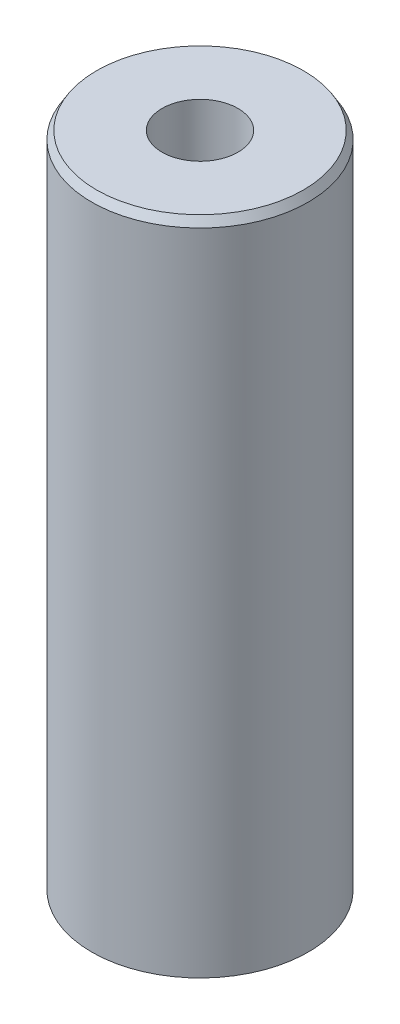
ISO-10303-21;
HEADER;
FILE_DESCRIPTION(('STEP AP214'),'2;1');
FILE_NAME('part.step','',(''),(''),'','','');
FILE_SCHEMA(('AUTOMOTIVE_DESIGN { 1 0 10303 214 1 1 1 1 }'));
ENDSEC;
DATA;
#1=APPLICATION_CONTEXT('core data for automotive mechanical design processes');
#2=APPLICATION_PROTOCOL_DEFINITION('international standard','automotive_design',2000,#1);
#3=PRODUCT_CONTEXT('',#1,'mechanical');
#4=PRODUCT('Part','Part','',(#3));
#5=PRODUCT_RELATED_PRODUCT_CATEGORY('part','',(#4));
#6=PRODUCT_DEFINITION_FORMATION('','',#4);
#7=PRODUCT_DEFINITION_CONTEXT('part definition',#1,'design');
#8=PRODUCT_DEFINITION('design','',#6,#7);
#9=PRODUCT_DEFINITION_SHAPE('','',#8);
#10=(LENGTH_UNIT() NAMED_UNIT(*) SI_UNIT(.MILLI.,.METRE.));
#11=(NAMED_UNIT(*) PLANE_ANGLE_UNIT() SI_UNIT($,.RADIAN.));
#12=(NAMED_UNIT(*) SI_UNIT($,.STERADIAN.) SOLID_ANGLE_UNIT());
#13=UNCERTAINTY_MEASURE_WITH_UNIT(LENGTH_MEASURE(1.E-05),#10,'distance_accuracy_value','');
#14=(GEOMETRIC_REPRESENTATION_CONTEXT(3) GLOBAL_UNCERTAINTY_ASSIGNED_CONTEXT((#13)) GLOBAL_UNIT_ASSIGNED_CONTEXT((#10,
#11,#12)) REPRESENTATION_CONTEXT('',''));
#15=CARTESIAN_POINT('',(0.,0.,0.));
#16=DIRECTION('',(0.,0.,1.));
#17=DIRECTION('',(1.,0.,0.));
#18=AXIS2_PLACEMENT_3D('',#15,#16,#17);
#19=CARTESIAN_POINT('',(0.,30.5851272626946,0.));
#20=DIRECTION('',(0.,-1.,0.));
#21=DIRECTION('',(0.,0.,-1.));
#22=AXIS2_PLACEMENT_3D('',#19,#20,#21);
#23=CYLINDRICAL_SURFACE('',#22,5.);
#24=CARTESIAN_POINT('',(0.,30.2119266062124,0.));
#25=DIRECTION('',(0.,1.,0.));
#26=DIRECTION('',(0.,0.,1.));
#27=AXIS2_PLACEMENT_3D('',#24,#25,#26);
#28=CIRCLE('',#27,5.);
#29=CARTESIAN_POINT('',(0.,30.2119266062124,-5.));
#30=VERTEX_POINT('',#29);
#31=EDGE_CURVE('E50',#30,#30,#28,.F.);
#32=CARTESIAN_POINT('',(0.,0.225915997946528,0.));
#33=DIRECTION('',(0.,1.,0.));
#34=DIRECTION('',(0.,0.,1.));
#35=AXIS2_PLACEMENT_3D('',#32,#33,#34);
#36=CIRCLE('',#35,5.);
#37=CARTESIAN_POINT('',(0.,0.225915997946528,-5.));
#38=VERTEX_POINT('',#37);
#39=EDGE_CURVE('E51',#38,#38,#36,.T.);
#40=CARTESIAN_POINT('',(0.,30.2119266062124,-5.));
#41=CARTESIAN_POINT('',(0.,29.899572329043,-5.));
#42=CARTESIAN_POINT('',(0.,29.5872180518735,-5.));
#43=CARTESIAN_POINT('',(0.,28.9625094975347,-5.));
#44=CARTESIAN_POINT('',(0.,28.6501552203652,-5.));
#45=CARTESIAN_POINT('',(0.,28.0254466660264,-5.));
#46=CARTESIAN_POINT('',(0.,27.7130923888569,-5.));
#47=CARTESIAN_POINT('',(0.,27.0883838345181,-5.));
#48=CARTESIAN_POINT('',(0.,26.7760295573486,-5.));
#49=CARTESIAN_POINT('',(0.,26.1513210030097,-5.));
#50=CARTESIAN_POINT('',(0.,25.8389667258403,-5.));
#51=CARTESIAN_POINT('',(0.,25.2142581715014,-5.));
#52=CARTESIAN_POINT('',(0.,24.901903894332,-5.));
#53=CARTESIAN_POINT('',(0.,24.2771953399931,-5.));
#54=CARTESIAN_POINT('',(0.,23.9648410628237,-5.));
#55=CARTESIAN_POINT('',(0.,23.3401325084848,-5.));
#56=CARTESIAN_POINT('',(0.,23.0277782313154,-5.));
#57=CARTESIAN_POINT('',(0.,22.4030696769765,-5.));
#58=CARTESIAN_POINT('',(0.,22.0907153998071,-5.));
#59=CARTESIAN_POINT('',(0.,21.4660068454682,-5.));
#60=CARTESIAN_POINT('',(0.,21.1536525682988,-5.));
#61=CARTESIAN_POINT('',(0.,20.5289440139599,-5.));
#62=CARTESIAN_POINT('',(0.,20.2165897367905,-5.));
#63=CARTESIAN_POINT('',(0.,19.5918811824516,-5.));
#64=CARTESIAN_POINT('',(0.,19.2795269052822,-5.));
#65=CARTESIAN_POINT('',(0.,18.6548183509433,-5.));
#66=CARTESIAN_POINT('',(0.,18.3424640737738,-5.));
#67=CARTESIAN_POINT('',(0.,17.717755519435,-5.));
#68=CARTESIAN_POINT('',(0.,17.4054012422655,-5.));
#69=CARTESIAN_POINT('',(0.,16.7806926879267,-5.));
#70=CARTESIAN_POINT('',(0.,16.4683384107572,-5.));
#71=CARTESIAN_POINT('',(0.,15.8436298564183,-5.));
#72=CARTESIAN_POINT('',(0.,15.5312755792489,-5.));
#73=CARTESIAN_POINT('',(0.,14.90656702491,-5.));
#74=CARTESIAN_POINT('',(0.,14.5942127477406,-5.));
#75=CARTESIAN_POINT('',(0.,13.9695041934017,-5.));
#76=CARTESIAN_POINT('',(0.,13.6571499162323,-5.));
#77=CARTESIAN_POINT('',(0.,13.0324413618934,-5.));
#78=CARTESIAN_POINT('',(0.,12.720087084724,-5.));
#79=CARTESIAN_POINT('',(0.,12.0953785303851,-5.));
#80=CARTESIAN_POINT('',(0.,11.7830242532157,-5.));
#81=CARTESIAN_POINT('',(0.,11.1583156988768,-5.));
#82=CARTESIAN_POINT('',(0.,10.8459614217074,-5.));
#83=CARTESIAN_POINT('',(0.,10.2212528673685,-5.));
#84=CARTESIAN_POINT('',(0.,9.90889859019906,-5.));
#85=CARTESIAN_POINT('',(0.,9.28419003586019,-5.));
#86=CARTESIAN_POINT('',(0.,8.97183575869075,-5.));
#87=CARTESIAN_POINT('',(0.,8.34712720435188,-5.));
#88=CARTESIAN_POINT('',(0.,8.03477292718244,-5.));
#89=CARTESIAN_POINT('',(0.,7.41006437284356,-5.));
#90=CARTESIAN_POINT('',(0.,7.09771009567413,-5.));
#91=CARTESIAN_POINT('',(0.,6.47300154133525,-5.));
#92=CARTESIAN_POINT('',(0.,6.16064726416582,-5.));
#93=CARTESIAN_POINT('',(0.,5.53593870982695,-5.));
#94=CARTESIAN_POINT('',(0.,5.22358443265751,-5.));
#95=CARTESIAN_POINT('',(0.,4.59887587831864,-5.));
#96=CARTESIAN_POINT('',(0.,4.2865216011492,-5.));
#97=CARTESIAN_POINT('',(0.,3.66181304681033,-5.));
#98=CARTESIAN_POINT('',(0.,3.34945876964089,-5.));
#99=CARTESIAN_POINT('',(0.,2.72475021530202,-5.));
#100=CARTESIAN_POINT('',(0.,2.41239593813258,-5.));
#101=CARTESIAN_POINT('',(0.,1.78768738379371,-5.));
#102=CARTESIAN_POINT('',(0.,1.47533310662427,-5.));
#103=CARTESIAN_POINT('',(0.,0.8506245522854,-5.));
#104=CARTESIAN_POINT('',(0.,0.538270275115964,-5.));
#105=CARTESIAN_POINT('',(0.,0.225915997946528,-5.));
#106=B_SPLINE_CURVE_WITH_KNOTS('',3,(#40,#41,#42,#43,#44,#45,#46,#47,#48,#49,#50,#51,#52,#53,
#54,#55,#56,#57,#58,#59,#60,#61,#62,#63,#64,#65,#66,#67,#68,#69,#70,#71,#72,#73,#74,#75,#76,#77,
#78,#79,#80,#81,#82,#83,#84,#85,#86,#87,#88,#89,#90,#91,#92,#93,#94,#95,#96,#97,#98,#99,#100,
#101,#102,#103,#104,#105),.UNSPECIFIED.,.F.,.F.,(4,2,2,2,2,2,2,2,2,2,2,2,2,2,2,2,2,2,2,2,2,2,2,
2,2,2,2,2,2,2,2,2,4),(0.,0.937062831508312,1.87412566301662,2.81118849452493,3.74825132603324,
4.68531415754155,5.62237698904986,6.55943982055817,7.49650265206648,8.43356548357479,
9.37062831508309,10.3076911465914,11.2447539780997,12.181816809608,13.1188796411163,
14.0559424726246,14.9930053041329,15.9300681356413,16.8671309671496,17.8041937986579,
18.7412566301662,19.6783194616745,20.6153822931828,21.5524451246911,22.4895079561994,
23.4265707877077,24.363633619216,25.3006964507244,26.2377592822327,27.174822113741,
28.1118849452493,29.0489477767576,29.9860106082659),.UNSPECIFIED.);
#107=EDGE_CURVE('BSEAM39',#30,#38,#106,.T.);
#108=ORIENTED_EDGE('',*,*,#31,.T.);
#109=ORIENTED_EDGE('',*,*,#39,.T.);
#110=ORIENTED_EDGE('',*,*,#107,.T.);
#111=ORIENTED_EDGE('',*,*,#107,.F.);
#112=EDGE_LOOP('',(#108,#110,#109,#111));
#113=FACE_BOUND('',#112,.T.);
#114=ADVANCED_FACE('F39',(#113),#23,.T.);
#115=CARTESIAN_POINT('',(0.,30.5851272626946,0.));
#116=DIRECTION('',(0.,1.,0.));
#117=DIRECTION('',(0.,0.,1.));
#118=AXIS2_PLACEMENT_3D('',#115,#116,#117);
#119=PLANE('',#118);
#120=CARTESIAN_POINT('',(0.,30.5851272626946,0.));
#121=DIRECTION('',(0.,1.,0.));
#122=DIRECTION('',(0.,0.,1.));
#123=AXIS2_PLACEMENT_3D('',#120,#121,#122);
#124=CIRCLE('',#123,4.77408400205349);
#125=CARTESIAN_POINT('',(0.,30.5851272626946,-4.77408400205349));
#126=VERTEX_POINT('',#125);
#127=EDGE_CURVE('E54',#126,#126,#124,.T.);
#128=ORIENTED_EDGE('',*,*,#127,.T.);
#129=EDGE_LOOP('',(#128));
#130=FACE_BOUND('',#129,.T.);
#131=CARTESIAN_POINT('',(0.,30.5851272626946,0.));
#132=DIRECTION('',(0.,1.,0.));
#133=DIRECTION('',(0.,0.,1.));
#134=AXIS2_PLACEMENT_3D('',#131,#132,#133);
#135=CIRCLE('',#134,1.75337497175282);
#136=CARTESIAN_POINT('',(0.,30.5851272626946,-1.75337497175282));
#137=VERTEX_POINT('',#136);
#138=EDGE_CURVE('E58',#137,#137,#135,.T.);
#139=ORIENTED_EDGE('',*,*,#138,.F.);
#140=EDGE_LOOP('',(#139));
#141=FACE_BOUND('',#140,.T.);
#142=ADVANCED_FACE('F69',(#130,#141),#119,.T.);
#143=CARTESIAN_POINT('',(0.,0.,0.));
#144=DIRECTION('',(0.,1.,0.));
#145=DIRECTION('',(0.,0.,1.));
#146=AXIS2_PLACEMENT_3D('',#143,#144,#145);
#147=PLANE('',#146);
#148=CARTESIAN_POINT('',(0.,0.,0.));
#149=DIRECTION('',(0.,1.,0.));
#150=DIRECTION('',(0.,0.,1.));
#151=AXIS2_PLACEMENT_3D('',#148,#149,#150);
#152=CIRCLE('',#151,4.62679934351784);
#153=CARTESIAN_POINT('',(0.,0.,4.62679934351784));
#154=VERTEX_POINT('',#153);
#155=EDGE_CURVE('E10',#154,#154,#152,.F.);
#156=ORIENTED_EDGE('',*,*,#155,.T.);
#157=EDGE_LOOP('',(#156));
#158=FACE_BOUND('',#157,.T.);
#159=CARTESIAN_POINT('',(0.,0.,0.));
#160=DIRECTION('',(0.,1.,0.));
#161=DIRECTION('',(0.,0.,1.));
#162=AXIS2_PLACEMENT_3D('',#159,#160,#161);
#163=CIRCLE('',#162,1.75337497175282);
#164=CARTESIAN_POINT('',(0.,0.,-1.75337497175282));
#165=VERTEX_POINT('',#164);
#166=EDGE_CURVE('E63',#165,#165,#163,.T.);
#167=ORIENTED_EDGE('',*,*,#166,.T.);
#168=EDGE_LOOP('',(#167));
#169=FACE_BOUND('',#168,.T.);
#170=ADVANCED_FACE('F75',(#158,#169),#147,.F.);
#171=CARTESIAN_POINT('',(0.,30.5851272626946,0.));
#172=DIRECTION('',(0.,-1.,0.));
#173=DIRECTION('',(0.,0.,-1.));
#174=AXIS2_PLACEMENT_3D('',#171,#172,#173);
#175=CYLINDRICAL_SURFACE('',#174,1.75337497175282);
#176=CARTESIAN_POINT('',(0.,30.5851272626946,-1.75337497175282));
#177=CARTESIAN_POINT('',(0.,30.2665321870415,-1.75337497175282));
#178=CARTESIAN_POINT('',(0.,29.9479371113884,-1.75337497175282));
#179=CARTESIAN_POINT('',(0.,29.3107469600823,-1.75337497175282));
#180=CARTESIAN_POINT('',(0.,28.9921518844292,-1.75337497175282));
#181=CARTESIAN_POINT('',(0.,28.3549617331231,-1.75337497175282));
#182=CARTESIAN_POINT('',(0.,28.03636665747,-1.75337497175282));
#183=CARTESIAN_POINT('',(0.,27.3991765061639,-1.75337497175282));
#184=CARTESIAN_POINT('',(0.,27.0805814305108,-1.75337497175282));
#185=CARTESIAN_POINT('',(0.,26.4433912792047,-1.75337497175282));
#186=CARTESIAN_POINT('',(0.,26.1247962035516,-1.75337497175282));
#187=CARTESIAN_POINT('',(0.,25.4876060522455,-1.75337497175282));
#188=CARTESIAN_POINT('',(0.,25.1690109765924,-1.75337497175282));
#189=CARTESIAN_POINT('',(0.,24.5318208252863,-1.75337497175282));
#190=CARTESIAN_POINT('',(0.,24.2132257496332,-1.75337497175282));
#191=CARTESIAN_POINT('',(0.,23.5760355983271,-1.75337497175282));
#192=CARTESIAN_POINT('',(0.,23.257440522674,-1.75337497175282));
#193=CARTESIAN_POINT('',(0.,22.6202503713679,-1.75337497175282));
#194=CARTESIAN_POINT('',(0.,22.3016552957148,-1.75337497175282));
#195=CARTESIAN_POINT('',(0.,21.6644651444086,-1.75337497175282));
#196=CARTESIAN_POINT('',(0.,21.3458700687556,-1.75337497175282));
#197=CARTESIAN_POINT('',(0.,20.7086799174494,-1.75337497175282));
#198=CARTESIAN_POINT('',(0.,20.3900848417964,-1.75337497175282));
#199=CARTESIAN_POINT('',(0.,19.7528946904902,-1.75337497175282));
#200=CARTESIAN_POINT('',(0.,19.4342996148372,-1.75337497175282));
#201=CARTESIAN_POINT('',(0.,18.797109463531,-1.75337497175282));
#202=CARTESIAN_POINT('',(0.,18.478514387878,-1.75337497175282));
#203=CARTESIAN_POINT('',(0.,17.8413242365718,-1.75337497175282));
#204=CARTESIAN_POINT('',(0.,17.5227291609188,-1.75337497175282));
#205=CARTESIAN_POINT('',(0.,16.8855390096126,-1.75337497175282));
#206=CARTESIAN_POINT('',(0.,16.5669439339596,-1.75337497175282));
#207=CARTESIAN_POINT('',(0.,15.9297537826534,-1.75337497175282));
#208=CARTESIAN_POINT('',(0.,15.6111587070003,-1.75337497175282));
#209=CARTESIAN_POINT('',(0.,14.9739685556942,-1.75337497175282));
#210=CARTESIAN_POINT('',(0.,14.6553734800411,-1.75337497175282));
#211=CARTESIAN_POINT('',(0.,14.018183328735,-1.75337497175282));
#212=CARTESIAN_POINT('',(0.,13.6995882530819,-1.75337497175282));
#213=CARTESIAN_POINT('',(0.,13.0623981017758,-1.75337497175282));
#214=CARTESIAN_POINT('',(0.,12.7438030261227,-1.75337497175282));
#215=CARTESIAN_POINT('',(0.,12.1066128748166,-1.75337497175282));
#216=CARTESIAN_POINT('',(0.,11.7880177991635,-1.75337497175282));
#217=CARTESIAN_POINT('',(0.,11.1508276478574,-1.75337497175282));
#218=CARTESIAN_POINT('',(0.,10.8322325722043,-1.75337497175282));
#219=CARTESIAN_POINT('',(0.,10.1950424208982,-1.75337497175282));
#220=CARTESIAN_POINT('',(0.,9.87644734524512,-1.75337497175282));
#221=CARTESIAN_POINT('',(0.,9.23925719393898,-1.75337497175282));
#222=CARTESIAN_POINT('',(0.,8.92066211828591,-1.75337497175282));
#223=CARTESIAN_POINT('',(0.,8.28347196697978,-1.75337497175282));
#224=CARTESIAN_POINT('',(0.,7.96487689132671,-1.75337497175282));
#225=CARTESIAN_POINT('',(0.,7.32768674002057,-1.75337497175282));
#226=CARTESIAN_POINT('',(0.,7.0090916643675,-1.75337497175282));
#227=CARTESIAN_POINT('',(0.,6.37190151306137,-1.75337497175282));
#228=CARTESIAN_POINT('',(0.,6.0533064374083,-1.75337497175282));
#229=CARTESIAN_POINT('',(0.,5.41611628610216,-1.75337497175282));
#230=CARTESIAN_POINT('',(0.,5.09752121044909,-1.75337497175282));
#231=CARTESIAN_POINT('',(0.,4.46033105914296,-1.75337497175282));
#232=CARTESIAN_POINT('',(0.,4.14173598348989,-1.75337497175282));
#233=CARTESIAN_POINT('',(0.,3.50454583218375,-1.75337497175282));
#234=CARTESIAN_POINT('',(0.,3.18595075653068,-1.75337497175282));
#235=CARTESIAN_POINT('',(0.,2.54876060522454,-1.75337497175282));
#236=CARTESIAN_POINT('',(0.,2.23016552957148,-1.75337497175282));
#237=CARTESIAN_POINT('',(0.,1.59297537826534,-1.75337497175282));
#238=CARTESIAN_POINT('',(0.,1.27438030261227,-1.75337497175282));
#239=CARTESIAN_POINT('',(0.,0.637190151306134,-1.75337497175282));
#240=CARTESIAN_POINT('',(0.,0.318595075653065,-1.75337497175282));
#241=CARTESIAN_POINT('',(0.,0.,-1.75337497175282));
#242=B_SPLINE_CURVE_WITH_KNOTS('',3,(#176,#177,#178,#179,#180,#181,#182,#183,#184,#185,#186,
#187,#188,#189,#190,#191,#192,#193,#194,#195,#196,#197,#198,#199,#200,#201,#202,#203,#204,#205,
#206,#207,#208,#209,#210,#211,#212,#213,#214,#215,#216,#217,#218,#219,#220,#221,#222,#223,#224,
#225,#226,#227,#228,#229,#230,#231,#232,#233,#234,#235,#236,#237,#238,#239,#240,#241),
.UNSPECIFIED.,.F.,.F.,(4,2,2,2,2,2,2,2,2,2,2,2,2,2,2,2,2,2,2,2,2,2,2,2,2,2,2,2,2,2,2,2,4),(0.,
0.955785226959206,1.91157045391841,2.86735568087762,3.82314090783682,4.77892613479603,
5.73471136175523,6.69049658871444,7.64628181567364,8.60206704263285,9.55785226959206,
10.5136374965513,11.4694227235105,12.4252079504697,13.3809931774289,14.3367784043881,
15.2925636313473,16.2483488583065,17.2041340852657,18.1599193122249,19.1157045391841,
20.0714897661433,21.0272749931025,21.9830602200617,22.9388454470209,23.8946306739801,
24.8504159009393,25.8062011278985,26.7619863548577,27.717771581817,28.6735568087762,
29.6293420357354,30.5851272626946),.UNSPECIFIED.);
#243=EDGE_CURVE('BSEAM70',#137,#165,#242,.T.);
#244=ORIENTED_EDGE('',*,*,#138,.T.);
#245=ORIENTED_EDGE('',*,*,#166,.F.);
#246=ORIENTED_EDGE('',*,*,#243,.T.);
#247=ORIENTED_EDGE('',*,*,#243,.F.);
#248=EDGE_LOOP('',(#244,#246,#245,#247));
#249=FACE_BOUND('',#248,.T.);
#250=ADVANCED_FACE('F70',(#249),#175,.F.);
#251=CARTESIAN_POINT('',(0.,30.5851272626946,0.));
#252=DIRECTION('',(0.,-1.,0.));
#253=DIRECTION('',(0.,0.,-1.));
#254=AXIS2_PLACEMENT_3D('',#251,#252,#253);
#255=CONICAL_SURFACE('',#254,4.77408400205349,0.54434204144205);
#256=CARTESIAN_POINT('',(0.,30.2119266062124,-5.));
#257=CARTESIAN_POINT('',(0.,30.2158141130508,-4.99764670835472));
#258=CARTESIAN_POINT('',(0.,30.2197016198891,-4.99529341670945));
#259=CARTESIAN_POINT('',(0.,30.2274766335658,-4.9905868334189));
#260=CARTESIAN_POINT('',(0.,30.2313641404042,-4.98823354177362));
#261=CARTESIAN_POINT('',(0.,30.2391391540809,-4.98352695848307));
#262=CARTESIAN_POINT('',(0.,30.2430266609193,-4.98117366683779));
#263=CARTESIAN_POINT('',(0.,30.250801674596,-4.97646708354724));
#264=CARTESIAN_POINT('',(0.,30.2546891814343,-4.97411379190196));
#265=CARTESIAN_POINT('',(0.,30.262464195111,-4.96940720861141));
#266=CARTESIAN_POINT('',(0.,30.2663517019494,-4.96705391696613));
#267=CARTESIAN_POINT('',(0.,30.2741267156261,-4.96234733367558));
#268=CARTESIAN_POINT('',(0.,30.2780142224645,-4.95999404203031));
#269=CARTESIAN_POINT('',(0.,30.2857892361412,-4.95528745873975));
#270=CARTESIAN_POINT('',(0.,30.2896767429795,-4.95293416709448));
#271=CARTESIAN_POINT('',(0.,30.2974517566562,-4.94822758380392));
#272=CARTESIAN_POINT('',(0.,30.3013392634946,-4.94587429215865));
#273=CARTESIAN_POINT('',(0.,30.3091142771713,-4.9411677088681));
#274=CARTESIAN_POINT('',(0.,30.3130017840097,-4.93881441722282));
#275=CARTESIAN_POINT('',(0.,30.3207767976864,-4.93410783393227));
#276=CARTESIAN_POINT('',(0.,30.3246643045247,-4.93175454228699));
#277=CARTESIAN_POINT('',(0.,30.3324393182014,-4.92704795899644));
#278=CARTESIAN_POINT('',(0.,30.3363268250398,-4.92469466735116));
#279=CARTESIAN_POINT('',(0.,30.3441018387165,-4.91998808406061));
#280=CARTESIAN_POINT('',(0.,30.3479893455549,-4.91763479241533));
#281=CARTESIAN_POINT('',(0.,30.3557643592316,-4.91292820912478));
#282=CARTESIAN_POINT('',(0.,30.3596518660699,-4.91057491747951));
#283=CARTESIAN_POINT('',(0.,30.3674268797466,-4.90586833418895));
#284=CARTESIAN_POINT('',(0.,30.371314386585,-4.90351504254368));
#285=CARTESIAN_POINT('',(0.,30.3790894002617,-4.89880845925312));
#286=CARTESIAN_POINT('',(0.,30.3829769071001,-4.89645516760785));
#287=CARTESIAN_POINT('',(0.,30.3907519207768,-4.8917485843173));
#288=CARTESIAN_POINT('',(0.,30.3946394276151,-4.88939529267202));
#289=CARTESIAN_POINT('',(0.,30.4024144412918,-4.88468870938147));
#290=CARTESIAN_POINT('',(0.,30.4063019481302,-4.88233541773619));
#291=CARTESIAN_POINT('',(0.,30.4140769618069,-4.87762883444564));
#292=CARTESIAN_POINT('',(0.,30.4179644686453,-4.87527554280036));
#293=CARTESIAN_POINT('',(0.,30.425739482322,-4.87056895950981));
#294=CARTESIAN_POINT('',(0.,30.4296269891603,-4.86821566786453));
#295=CARTESIAN_POINT('',(0.,30.4374020028371,-4.86350908457398));
#296=CARTESIAN_POINT('',(0.,30.4412895096754,-4.86115579292871));
#297=CARTESIAN_POINT('',(0.,30.4490645233521,-4.85644920963815));
#298=CARTESIAN_POINT('',(0.,30.4529520301905,-4.85409591799288));
#299=CARTESIAN_POINT('',(0.,30.4607270438672,-4.84938933470232));
#300=CARTESIAN_POINT('',(0.,30.4646145507055,-4.84703604305705));
#301=CARTESIAN_POINT('',(0.,30.4723895643822,-4.8423294597665));
#302=CARTESIAN_POINT('',(0.,30.4762770712206,-4.83997616812122));
#303=CARTESIAN_POINT('',(0.,30.4840520848973,-4.83526958483067));
#304=CARTESIAN_POINT('',(0.,30.4879395917357,-4.83291629318539));
#305=CARTESIAN_POINT('',(0.,30.4957146054124,-4.82820970989484));
#306=CARTESIAN_POINT('',(0.,30.4996021122507,-4.82585641824956));
#307=CARTESIAN_POINT('',(0.,30.5073771259275,-4.82114983495901));
#308=CARTESIAN_POINT('',(0.,30.5112646327658,-4.81879654331374));
#309=CARTESIAN_POINT('',(0.,30.5190396464425,-4.81408996002318));
#310=CARTESIAN_POINT('',(0.,30.5229271532809,-4.81173666837791));
#311=CARTESIAN_POINT('',(0.,30.5307021669576,-4.80703008508735));
#312=CARTESIAN_POINT('',(0.,30.5345896737959,-4.80467679344208));
#313=CARTESIAN_POINT('',(0.,30.5423646874727,-4.79997021015153));
#314=CARTESIAN_POINT('',(0.,30.546252194311,-4.79761691850625));
#315=CARTESIAN_POINT('',(0.,30.5540272079877,-4.7929103352157));
#316=CARTESIAN_POINT('',(0.,30.5579147148261,-4.79055704357042));
#317=CARTESIAN_POINT('',(0.,30.5656897285028,-4.78585046027987));
#318=CARTESIAN_POINT('',(0.,30.5695772353411,-4.78349716863459));
#319=CARTESIAN_POINT('',(0.,30.5773522490179,-4.77879058534404));
#320=CARTESIAN_POINT('',(0.,30.5812397558562,-4.77643729369876));
#321=CARTESIAN_POINT('',(0.,30.5851272626946,-4.77408400205349));
#322=B_SPLINE_CURVE_WITH_KNOTS('',3,(#256,#257,#258,#259,#260,#261,#262,#263,#264,#265,#266,
#267,#268,#269,#270,#271,#272,#273,#274,#275,#276,#277,#278,#279,#280,#281,#282,#283,#284,#285,
#286,#287,#288,#289,#290,#291,#292,#293,#294,#295,#296,#297,#298,#299,#300,#301,#302,#303,#304,
#305,#306,#307,#308,#309,#310,#311,#312,#313,#314,#315,#316,#317,#318,#319,#320,#321),
.UNSPECIFIED.,.F.,.F.,(4,2,2,2,2,2,2,2,2,2,2,2,2,2,2,2,2,2,2,2,2,2,2,2,2,2,2,2,2,2,2,2,4),(0.,
0.0136329094060595,0.0272658188121224,0.0408987282181853,0.0545316376242477,0.0681645470303077,
0.0817974564363706,0.095430365842433,0.109063275248496,0.122696184654558,0.136329094060618,
0.149962003466681,0.163594912872744,0.177227822278807,0.190860731684867,0.204493641090929,
0.218126550496992,0.231759459903054,0.245392369309117,0.259025278715177,0.27265818812124,
0.286291097527303,0.299924006933365,0.313556916339425,0.327189825745488,0.34082273515155,
0.354455644557613,0.368088553963676,0.381721463369736,0.395354372775798,0.408987282181861,
0.422620191587924,0.436253100993987),.UNSPECIFIED.);
#323=EDGE_CURVE('BSEAM81',#30,#126,#322,.T.);
#324=ORIENTED_EDGE('',*,*,#31,.F.);
#325=ORIENTED_EDGE('',*,*,#127,.F.);
#326=ORIENTED_EDGE('',*,*,#323,.T.);
#327=ORIENTED_EDGE('',*,*,#323,.F.);
#328=EDGE_LOOP('',(#324,#326,#325,#327));
#329=FACE_BOUND('',#328,.T.);
#330=ADVANCED_FACE('F81',(#329),#255,.T.);
#331=CARTESIAN_POINT('',(0.,0.225915997946528,0.));
#332=DIRECTION('',(0.,1.,0.));
#333=DIRECTION('',(0.,0.,1.));
#334=AXIS2_PLACEMENT_3D('',#331,#332,#333);
#335=CONICAL_SURFACE('',#334,5.,1.02645428535284);
#336=ORIENTED_EDGE('',*,*,#155,.F.);
#337=EDGE_LOOP('',(#336));
#338=FACE_BOUND('',#337,.T.);
#339=ORIENTED_EDGE('',*,*,#39,.F.);
#340=EDGE_LOOP('',(#339));
#341=FACE_BOUND('',#340,.T.);
#342=ADVANCED_FACE('F45',(#338,#341),#335,.T.);
#343=CLOSED_SHELL('',(#114,#142,#170,#250,#330,#342));
#344=MANIFOLD_SOLID_BREP('B2',#343);
#345=ADVANCED_BREP_SHAPE_REPRESENTATION('',(#18,#344),#14);
#346=SHAPE_DEFINITION_REPRESENTATION(#9,#345);
ENDSEC;
END-ISO-10303-21;
